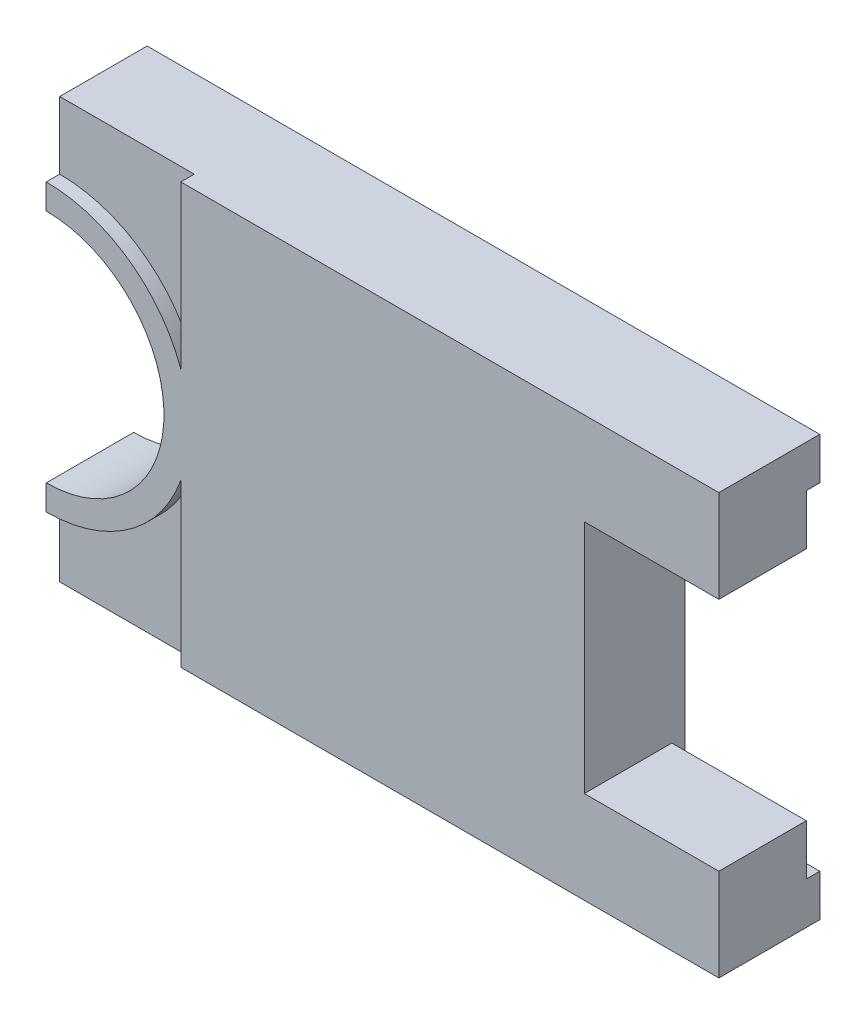
ISO-10303-21;
HEADER;
FILE_DESCRIPTION(('STEP AP214'),'2;1');
FILE_NAME('part.step','',(''),(''),'','','');
FILE_SCHEMA(('AUTOMOTIVE_DESIGN { 1 0 10303 214 1 1 1 1 }'));
ENDSEC;
DATA;
#1=APPLICATION_CONTEXT('core data for automotive mechanical design processes');
#2=APPLICATION_PROTOCOL_DEFINITION('international standard','automotive_design',2000,#1);
#3=PRODUCT_CONTEXT('',#1,'mechanical');
#4=PRODUCT('Part','Part','',(#3));
#5=PRODUCT_RELATED_PRODUCT_CATEGORY('part','',(#4));
#6=PRODUCT_DEFINITION_FORMATION('','',#4);
#7=PRODUCT_DEFINITION_CONTEXT('part definition',#1,'design');
#8=PRODUCT_DEFINITION('design','',#6,#7);
#9=PRODUCT_DEFINITION_SHAPE('','',#8);
#10=(LENGTH_UNIT() NAMED_UNIT(*) SI_UNIT(.MILLI.,.METRE.));
#11=(NAMED_UNIT(*) PLANE_ANGLE_UNIT() SI_UNIT($,.RADIAN.));
#12=(NAMED_UNIT(*) SI_UNIT($,.STERADIAN.) SOLID_ANGLE_UNIT());
#13=UNCERTAINTY_MEASURE_WITH_UNIT(LENGTH_MEASURE(1.E-05),#10,'distance_accuracy_value','');
#14=(GEOMETRIC_REPRESENTATION_CONTEXT(3) GLOBAL_UNCERTAINTY_ASSIGNED_CONTEXT((#13)) GLOBAL_UNIT_ASSIGNED_CONTEXT((#10,
#11,#12)) REPRESENTATION_CONTEXT('',''));
#15=CARTESIAN_POINT('',(0.,0.,0.));
#16=DIRECTION('',(0.,0.,1.));
#17=DIRECTION('',(1.,0.,0.));
#18=AXIS2_PLACEMENT_3D('',#15,#16,#17);
#19=CARTESIAN_POINT('',(-0.2,0.,0.04));
#20=DIRECTION('',(0.,0.,1.));
#21=DIRECTION('',(1.,0.,0.));
#22=AXIS2_PLACEMENT_3D('',#19,#20,#21);
#23=PLANE('',#22);
#24=DIRECTION('',(0.,-1.,0.));
#25=VECTOR('',#24,1.);
#26=CARTESIAN_POINT('',(0.2,-0.230940107676,0.04));
#27=LINE('',#26,#25);
#28=CARTESIAN_POINT('',(0.200000000000004,-0.230940107675994,0.04));
#29=VERTEX_POINT('',#28);
#30=CARTESIAN_POINT('',(0.2,0.230940107676,0.04));
#31=VERTEX_POINT('',#30);
#32=EDGE_CURVE('E160',#29,#31,#27,.F.);
#33=ORIENTED_EDGE('',*,*,#32,.F.);
#34=DIRECTION('',(-0.866025403784329,0.50000000000019,0.));
#35=VECTOR('',#34,1.);
#36=CARTESIAN_POINT('',(-0.2,0.,0.04));
#37=LINE('',#36,#35);
#38=CARTESIAN_POINT('',(-0.200000000000004,0.,0.04));
#39=VERTEX_POINT('',#38);
#40=EDGE_CURVE('E462',#39,#29,#37,.F.);
#41=ORIENTED_EDGE('',*,*,#40,.F.);
#42=DIRECTION('',(0.866025403784329,0.50000000000019,0.));
#43=VECTOR('',#42,1.);
#44=CARTESIAN_POINT('',(0.2,0.230940107676,0.04));
#45=LINE('',#44,#43);
#46=EDGE_CURVE('E453',#31,#39,#45,.F.);
#47=ORIENTED_EDGE('',*,*,#46,.F.);
#48=EDGE_LOOP('',(#33,#41,#47));
#49=FACE_BOUND('',#48,.T.);
#50=ADVANCED_FACE('F16',(#49),#23,.F.);
#51=CARTESIAN_POINT('',(-1.,-0.625,0.3));
#52=DIRECTION('',(0.,1.,0.));
#53=DIRECTION('',(-1.,0.,0.));
#54=AXIS2_PLACEMENT_3D('',#51,#52,#53);
#55=PLANE('',#54);
#56=DIRECTION('',(-1.,0.,0.));
#57=VECTOR('',#56,1.);
#58=CARTESIAN_POINT('',(-1.,-0.625,0.26));
#59=LINE('',#58,#57);
#60=CARTESIAN_POINT('',(-1.,-0.625,0.26));
#61=VERTEX_POINT('',#60);
#62=CARTESIAN_POINT('',(-0.6,-0.625,0.26));
#63=VERTEX_POINT('',#62);
#64=EDGE_CURVE('E161',#61,#63,#59,.F.);
#65=ORIENTED_EDGE('',*,*,#64,.F.);
#66=DIRECTION('',(0.,0.,1.));
#67=VECTOR('',#66,1.);
#68=CARTESIAN_POINT('',(-1.,-0.625,0.3));
#69=LINE('',#68,#67);
#70=CARTESIAN_POINT('',(-1.,-0.625,0.));
#71=VERTEX_POINT('',#70);
#72=EDGE_CURVE('E177',#71,#61,#69,.T.);
#73=ORIENTED_EDGE('',*,*,#72,.F.);
#74=DIRECTION('',(1.,0.,0.));
#75=VECTOR('',#74,1.);
#76=CARTESIAN_POINT('',(-1.,-0.625,0.));
#77=LINE('',#76,#75);
#78=CARTESIAN_POINT('',(1.,-0.625,0.));
#79=VERTEX_POINT('',#78);
#80=EDGE_CURVE('E413',#71,#79,#77,.T.);
#81=ORIENTED_EDGE('',*,*,#80,.T.);
#82=DIRECTION('',(0.,0.,1.));
#83=VECTOR('',#82,1.);
#84=CARTESIAN_POINT('',(1.,-0.625,0.3));
#85=LINE('',#84,#83);
#86=CARTESIAN_POINT('',(1.,-0.625,0.3));
#87=VERTEX_POINT('',#86);
#88=EDGE_CURVE('E175',#87,#79,#85,.F.);
#89=ORIENTED_EDGE('',*,*,#88,.F.);
#90=DIRECTION('',(-1.,0.,0.));
#91=VECTOR('',#90,1.);
#92=CARTESIAN_POINT('',(-1.,-0.625,0.3));
#93=LINE('',#92,#91);
#94=CARTESIAN_POINT('',(-0.6,-0.625,0.3));
#95=VERTEX_POINT('',#94);
#96=EDGE_CURVE('E167',#95,#87,#93,.F.);
#97=ORIENTED_EDGE('',*,*,#96,.F.);
#98=DIRECTION('',(0.,0.,1.));
#99=VECTOR('',#98,1.);
#100=CARTESIAN_POINT('',(-0.6,-0.625,0.3));
#101=LINE('',#100,#99);
#102=EDGE_CURVE('E150',#63,#95,#101,.T.);
#103=ORIENTED_EDGE('',*,*,#102,.F.);
#104=EDGE_LOOP('',(#65,#73,#81,#89,#97,#103));
#105=FACE_BOUND('',#104,.T.);
#106=ADVANCED_FACE('F173',(#105),#55,.F.);
#107=CARTESIAN_POINT('',(0.2,-0.230940107676,0.04));
#108=DIRECTION('',(-1.,0.,0.));
#109=DIRECTION('',(0.,-1.,0.));
#110=AXIS2_PLACEMENT_3D('',#107,#108,#109);
#111=PLANE('',#110);
#112=ORIENTED_EDGE('',*,*,#32,.T.);
#113=DIRECTION('',(0.,0.,1.));
#114=VECTOR('',#113,1.);
#115=CARTESIAN_POINT('',(0.2,0.230940107676,0.04));
#116=LINE('',#115,#114);
#117=CARTESIAN_POINT('',(0.2,0.230940107676,0.));
#118=VERTEX_POINT('',#117);
#119=EDGE_CURVE('E456',#118,#31,#116,.T.);
#120=ORIENTED_EDGE('',*,*,#119,.F.);
#121=DIRECTION('',(0.,1.,0.));
#122=VECTOR('',#121,1.);
#123=CARTESIAN_POINT('',(0.2,-0.625,0.));
#124=LINE('',#123,#122);
#125=CARTESIAN_POINT('',(0.200000000000004,-0.230940107675994,0.));
#126=VERTEX_POINT('',#125);
#127=EDGE_CURVE('E352',#118,#126,#124,.F.);
#128=ORIENTED_EDGE('',*,*,#127,.T.);
#129=DIRECTION('',(0.,0.,1.));
#130=VECTOR('',#129,1.);
#131=CARTESIAN_POINT('',(0.200000000000014,-0.230940107675975,0.04));
#132=LINE('',#131,#130);
#133=EDGE_CURVE('E459',#29,#126,#132,.F.);
#134=ORIENTED_EDGE('',*,*,#133,.F.);
#135=EDGE_LOOP('',(#112,#120,#128,#134));
#136=FACE_BOUND('',#135,.T.);
#137=ADVANCED_FACE('F512',(#136),#111,.T.);
#138=CARTESIAN_POINT('',(-0.2,0.,0.04));
#139=DIRECTION('',(0.50000000000019,0.866025403784329,0.));
#140=DIRECTION('',(-0.866025403784329,0.50000000000019,0.));
#141=AXIS2_PLACEMENT_3D('',#138,#139,#140);
#142=PLANE('',#141);
#143=ORIENTED_EDGE('',*,*,#40,.T.);
#144=ORIENTED_EDGE('',*,*,#133,.T.);
#145=DIRECTION('',(-0.866025403784298,0.500000000000243,0.));
#146=VECTOR('',#145,1.);
#147=CARTESIAN_POINT('',(0.2,-0.230940107676,0.));
#148=LINE('',#147,#146);
#149=CARTESIAN_POINT('',(-0.200000000000004,0.,0.));
#150=VERTEX_POINT('',#149);
#151=EDGE_CURVE('E349',#126,#150,#148,.T.);
#152=ORIENTED_EDGE('',*,*,#151,.T.);
#153=DIRECTION('',(0.,0.,1.));
#154=VECTOR('',#153,1.);
#155=CARTESIAN_POINT('',(-0.200000000000014,0.,0.04));
#156=LINE('',#155,#154);
#157=EDGE_CURVE('E401',#39,#150,#156,.F.);
#158=ORIENTED_EDGE('',*,*,#157,.F.);
#159=EDGE_LOOP('',(#143,#144,#152,#158));
#160=FACE_BOUND('',#159,.T.);
#161=ADVANCED_FACE('F517',(#160),#142,.T.);
#162=CARTESIAN_POINT('',(0.2,0.230940107676,0.04));
#163=DIRECTION('',(0.50000000000019,-0.866025403784329,0.));
#164=DIRECTION('',(0.866025403784329,0.50000000000019,0.));
#165=AXIS2_PLACEMENT_3D('',#162,#163,#164);
#166=PLANE('',#165);
#167=ORIENTED_EDGE('',*,*,#46,.T.);
#168=ORIENTED_EDGE('',*,*,#157,.T.);
#169=DIRECTION('',(0.866025403784298,0.500000000000243,0.));
#170=VECTOR('',#169,1.);
#171=CARTESIAN_POINT('',(-0.2,0.,0.));
#172=LINE('',#171,#170);
#173=EDGE_CURVE('E345',#150,#118,#172,.T.);
#174=ORIENTED_EDGE('',*,*,#173,.T.);
#175=ORIENTED_EDGE('',*,*,#119,.T.);
#176=EDGE_LOOP('',(#167,#168,#174,#175));
#177=FACE_BOUND('',#176,.T.);
#178=ADVANCED_FACE('F520',(#177),#166,.T.);
#179=CARTESIAN_POINT('',(-0.6,-0.35,2.377498685594));
#180=DIRECTION('',(-1.,0.,0.));
#181=DIRECTION('',(0.,0.,1.));
#182=AXIS2_PLACEMENT_3D('',#179,#180,#181);
#183=PLANE('',#182);
#184=DIRECTION('',(0.,1.,0.));
#185=VECTOR('',#184,1.);
#186=CARTESIAN_POINT('',(-0.6,-0.625,0.));
#187=LINE('',#186,#185);
#188=CARTESIAN_POINT('',(-0.6,0.5,0.));
#189=VERTEX_POINT('',#188);
#190=CARTESIAN_POINT('',(-0.6,-0.5,0.));
#191=VERTEX_POINT('',#190);
#192=EDGE_CURVE('E358',#189,#191,#187,.F.);
#193=ORIENTED_EDGE('',*,*,#192,.T.);
#194=DIRECTION('',(0.,0.,1.));
#195=VECTOR('',#194,1.);
#196=CARTESIAN_POINT('',(-0.6,-0.5,0.04));
#197=LINE('',#196,#195);
#198=CARTESIAN_POINT('',(-0.6,-0.5,0.04));
#199=VERTEX_POINT('',#198);
#200=EDGE_CURVE('E296',#199,#191,#197,.F.);
#201=ORIENTED_EDGE('',*,*,#200,.F.);
#202=DIRECTION('',(0.,1.,0.));
#203=VECTOR('',#202,1.);
#204=CARTESIAN_POINT('',(-0.6,-0.5,0.04));
#205=LINE('',#204,#203);
#206=CARTESIAN_POINT('',(-0.6,0.5,0.04));
#207=VERTEX_POINT('',#206);
#208=EDGE_CURVE('E295',#199,#207,#205,.T.);
#209=ORIENTED_EDGE('',*,*,#208,.T.);
#210=DIRECTION('',(0.,0.,-1.));
#211=VECTOR('',#210,1.);
#212=CARTESIAN_POINT('',(-0.6,0.5,0.04));
#213=LINE('',#212,#211);
#214=EDGE_CURVE('E304',#189,#207,#213,.F.);
#215=ORIENTED_EDGE('',*,*,#214,.F.);
#216=EDGE_LOOP('',(#193,#201,#209,#215));
#217=FACE_BOUND('',#216,.T.);
#218=ADVANCED_FACE('F847',(#217),#183,.T.);
#219=CARTESIAN_POINT('',(1.,-0.5,0.04));
#220=DIRECTION('',(0.,-1.,0.));
#221=DIRECTION('',(0.,0.,-1.));
#222=AXIS2_PLACEMENT_3D('',#219,#220,#221);
#223=PLANE('',#222);
#224=DIRECTION('',(0.,0.,1.));
#225=VECTOR('',#224,1.);
#226=CARTESIAN_POINT('',(0.6,-0.5,2.377498685594));
#227=LINE('',#226,#225);
#228=CARTESIAN_POINT('',(0.6,-0.5,0.));
#229=VERTEX_POINT('',#228);
#230=CARTESIAN_POINT('',(0.6,-0.5,0.0400000000000001));
#231=VERTEX_POINT('',#230);
#232=EDGE_CURVE('E392',#229,#231,#227,.T.);
#233=ORIENTED_EDGE('',*,*,#232,.T.);
#234=DIRECTION('',(-1.,0.,0.));
#235=VECTOR('',#234,1.);
#236=CARTESIAN_POINT('',(1.,-0.5,0.04));
#237=LINE('',#236,#235);
#238=CARTESIAN_POINT('',(1.,-0.5,0.04));
#239=VERTEX_POINT('',#238);
#240=EDGE_CURVE('E384',#239,#231,#237,.T.);
#241=ORIENTED_EDGE('',*,*,#240,.F.);
#242=DIRECTION('',(0.,0.,1.));
#243=VECTOR('',#242,1.);
#244=CARTESIAN_POINT('',(1.,-0.5,0.3));
#245=LINE('',#244,#243);
#246=CARTESIAN_POINT('',(1.,-0.5,0.));
#247=VERTEX_POINT('',#246);
#248=EDGE_CURVE('E419',#239,#247,#245,.F.);
#249=ORIENTED_EDGE('',*,*,#248,.T.);
#250=DIRECTION('',(1.,0.,0.));
#251=VECTOR('',#250,1.);
#252=CARTESIAN_POINT('',(-1.,-0.5,0.));
#253=LINE('',#252,#251);
#254=EDGE_CURVE('E355',#247,#229,#253,.F.);
#255=ORIENTED_EDGE('',*,*,#254,.T.);
#256=EDGE_LOOP('',(#233,#241,#249,#255));
#257=FACE_BOUND('',#256,.T.);
#258=ADVANCED_FACE('F838',(#257),#223,.F.);
#259=CARTESIAN_POINT('',(1.,-0.5,0.04));
#260=DIRECTION('',(0.,0.,-1.));
#261=DIRECTION('',(-1.,0.,0.));
#262=AXIS2_PLACEMENT_3D('',#259,#260,#261);
#263=PLANE('',#262);
#264=ORIENTED_EDGE('',*,*,#240,.T.);
#265=DIRECTION('',(0.,1.,0.));
#266=VECTOR('',#265,1.);
#267=CARTESIAN_POINT('',(0.6,-0.35,0.0400000000000001));
#268=LINE('',#267,#266);
#269=CARTESIAN_POINT('',(0.6,-0.35,0.0400000000000001));
#270=VERTEX_POINT('',#269);
#271=EDGE_CURVE('E264',#231,#270,#268,.T.);
#272=ORIENTED_EDGE('',*,*,#271,.T.);
#273=DIRECTION('',(1.,0.,0.));
#274=VECTOR('',#273,1.);
#275=CARTESIAN_POINT('',(1.,-0.35,0.0400000000000001));
#276=LINE('',#275,#274);
#277=CARTESIAN_POINT('',(1.,-0.35,0.0400000000000001));
#278=VERTEX_POINT('',#277);
#279=EDGE_CURVE('E274',#270,#278,#276,.T.);
#280=ORIENTED_EDGE('',*,*,#279,.T.);
#281=DIRECTION('',(0.,1.,0.));
#282=VECTOR('',#281,1.);
#283=CARTESIAN_POINT('',(1.,-0.625,0.04));
#284=LINE('',#283,#282);
#285=EDGE_CURVE('E416',#278,#239,#284,.F.);
#286=ORIENTED_EDGE('',*,*,#285,.T.);
#287=EDGE_LOOP('',(#264,#272,#280,#286));
#288=FACE_BOUND('',#287,.T.);
#289=ADVANCED_FACE('F540',(#288),#263,.T.);
#290=CARTESIAN_POINT('',(0.6,0.5,0.04));
#291=DIRECTION('',(0.,1.,0.));
#292=DIRECTION('',(0.,0.,1.));
#293=AXIS2_PLACEMENT_3D('',#290,#291,#292);
#294=PLANE('',#293);
#295=DIRECTION('',(0.,0.,1.));
#296=VECTOR('',#295,1.);
#297=CARTESIAN_POINT('',(1.,0.5,0.3));
#298=LINE('',#297,#296);
#299=CARTESIAN_POINT('',(1.,0.5,0.));
#300=VERTEX_POINT('',#299);
#301=CARTESIAN_POINT('',(1.,0.5,0.04));
#302=VERTEX_POINT('',#301);
#303=EDGE_CURVE('E342',#300,#302,#298,.T.);
#304=ORIENTED_EDGE('',*,*,#303,.T.);
#305=DIRECTION('',(-1.,0.,0.));
#306=VECTOR('',#305,1.);
#307=CARTESIAN_POINT('',(1.,0.5,0.04));
#308=LINE('',#307,#306);
#309=CARTESIAN_POINT('',(0.6,0.5,0.0400000000000001));
#310=VERTEX_POINT('',#309);
#311=EDGE_CURVE('E363',#310,#302,#308,.F.);
#312=ORIENTED_EDGE('',*,*,#311,.F.);
#313=DIRECTION('',(0.,0.,1.));
#314=VECTOR('',#313,1.);
#315=CARTESIAN_POINT('',(0.6,0.5,2.377498685594));
#316=LINE('',#315,#314);
#317=CARTESIAN_POINT('',(0.6,0.5,0.));
#318=VERTEX_POINT('',#317);
#319=EDGE_CURVE('E379',#310,#318,#316,.F.);
#320=ORIENTED_EDGE('',*,*,#319,.T.);
#321=DIRECTION('',(1.,0.,0.));
#322=VECTOR('',#321,1.);
#323=CARTESIAN_POINT('',(-1.,0.5,0.));
#324=LINE('',#323,#322);
#325=EDGE_CURVE('E359',#318,#300,#324,.T.);
#326=ORIENTED_EDGE('',*,*,#325,.T.);
#327=EDGE_LOOP('',(#304,#312,#320,#326));
#328=FACE_BOUND('',#327,.T.);
#329=ADVANCED_FACE('F819',(#328),#294,.F.);
#330=CARTESIAN_POINT('',(1.,-0.5,0.04));
#331=DIRECTION('',(0.,0.,-1.));
#332=DIRECTION('',(-1.,0.,0.));
#333=AXIS2_PLACEMENT_3D('',#330,#331,#332);
#334=PLANE('',#333);
#335=ORIENTED_EDGE('',*,*,#311,.T.);
#336=DIRECTION('',(0.,1.,0.));
#337=VECTOR('',#336,1.);
#338=CARTESIAN_POINT('',(1.,-0.625,0.04));
#339=LINE('',#338,#337);
#340=CARTESIAN_POINT('',(1.,0.35,0.04));
#341=VERTEX_POINT('',#340);
#342=EDGE_CURVE('E324',#302,#341,#339,.F.);
#343=ORIENTED_EDGE('',*,*,#342,.T.);
#344=DIRECTION('',(-1.,0.,0.));
#345=VECTOR('',#344,1.);
#346=CARTESIAN_POINT('',(0.6,0.35,0.0400000000000001));
#347=LINE('',#346,#345);
#348=CARTESIAN_POINT('',(0.6,0.35,0.0400000000000001));
#349=VERTEX_POINT('',#348);
#350=EDGE_CURVE('E241',#341,#349,#347,.T.);
#351=ORIENTED_EDGE('',*,*,#350,.T.);
#352=DIRECTION('',(0.,1.,0.));
#353=VECTOR('',#352,1.);
#354=CARTESIAN_POINT('',(0.6,-0.35,0.0400000000000001));
#355=LINE('',#354,#353);
#356=EDGE_CURVE('E263',#349,#310,#355,.T.);
#357=ORIENTED_EDGE('',*,*,#356,.T.);
#358=EDGE_LOOP('',(#335,#343,#351,#357));
#359=FACE_BOUND('',#358,.T.);
#360=ADVANCED_FACE('F809',(#359),#334,.T.);
#361=CARTESIAN_POINT('',(-1.,-0.625,0.));
#362=DIRECTION('',(0.,0.,1.));
#363=DIRECTION('',(1.,0.,0.));
#364=AXIS2_PLACEMENT_3D('',#361,#362,#363);
#365=PLANE('',#364);
#366=ORIENTED_EDGE('',*,*,#151,.F.);
#367=ORIENTED_EDGE('',*,*,#127,.F.);
#368=ORIENTED_EDGE('',*,*,#173,.F.);
#369=EDGE_LOOP('',(#366,#367,#368));
#370=FACE_BOUND('',#369,.T.);
#371=ORIENTED_EDGE('',*,*,#254,.F.);
#372=DIRECTION('',(0.,1.,0.));
#373=VECTOR('',#372,1.);
#374=CARTESIAN_POINT('',(1.,-0.625,0.));
#375=LINE('',#374,#373);
#376=EDGE_CURVE('E275',#247,#79,#375,.F.);
#377=ORIENTED_EDGE('',*,*,#376,.T.);
#378=ORIENTED_EDGE('',*,*,#80,.F.);
#379=DIRECTION('',(0.,1.,0.));
#380=VECTOR('',#379,1.);
#381=CARTESIAN_POINT('',(-1.,-0.625,0.));
#382=LINE('',#381,#380);
#383=CARTESIAN_POINT('',(-1.,-0.5,0.));
#384=VERTEX_POINT('',#383);
#385=EDGE_CURVE('E83',#384,#71,#382,.F.);
#386=ORIENTED_EDGE('',*,*,#385,.F.);
#387=DIRECTION('',(-1.,0.,0.));
#388=VECTOR('',#387,1.);
#389=CARTESIAN_POINT('',(-1.,-0.5,0.));
#390=LINE('',#389,#388);
#391=EDGE_CURVE('E302',#191,#384,#390,.T.);
#392=ORIENTED_EDGE('',*,*,#391,.F.);
#393=ORIENTED_EDGE('',*,*,#192,.F.);
#394=DIRECTION('',(1.,0.,0.));
#395=VECTOR('',#394,1.);
#396=CARTESIAN_POINT('',(-0.6,0.5,0.));
#397=LINE('',#396,#395);
#398=CARTESIAN_POINT('',(-1.,0.5,0.));
#399=VERTEX_POINT('',#398);
#400=EDGE_CURVE('E348',#399,#189,#397,.T.);
#401=ORIENTED_EDGE('',*,*,#400,.F.);
#402=DIRECTION('',(0.,1.,0.));
#403=VECTOR('',#402,1.);
#404=CARTESIAN_POINT('',(-1.,-0.625,0.));
#405=LINE('',#404,#403);
#406=CARTESIAN_POINT('',(-1.,0.625,0.));
#407=VERTEX_POINT('',#406);
#408=EDGE_CURVE('E356',#407,#399,#405,.F.);
#409=ORIENTED_EDGE('',*,*,#408,.F.);
#410=DIRECTION('',(1.,0.,0.));
#411=VECTOR('',#410,1.);
#412=CARTESIAN_POINT('',(1.,0.625,0.));
#413=LINE('',#412,#411);
#414=CARTESIAN_POINT('',(1.,0.625,0.));
#415=VERTEX_POINT('',#414);
#416=EDGE_CURVE('E229',#407,#415,#413,.T.);
#417=ORIENTED_EDGE('',*,*,#416,.T.);
#418=DIRECTION('',(0.,1.,0.));
#419=VECTOR('',#418,1.);
#420=CARTESIAN_POINT('',(1.,-0.625,0.));
#421=LINE('',#420,#419);
#422=EDGE_CURVE('E240',#415,#300,#421,.F.);
#423=ORIENTED_EDGE('',*,*,#422,.T.);
#424=ORIENTED_EDGE('',*,*,#325,.F.);
#425=DIRECTION('',(0.,1.,0.));
#426=VECTOR('',#425,1.);
#427=CARTESIAN_POINT('',(0.6,-0.35,0.));
#428=LINE('',#427,#426);
#429=EDGE_CURVE('E252',#318,#229,#428,.F.);
#430=ORIENTED_EDGE('',*,*,#429,.T.);
#431=EDGE_LOOP('',(#371,#377,#378,#386,#392,#393,#401,#409,#417,#423,#424,#430));
#432=FACE_BOUND('',#431,.T.);
#433=ADVANCED_FACE('F484',(#370,#432),#365,.F.);
#434=CARTESIAN_POINT('',(-0.6,0.5,0.04));
#435=DIRECTION('',(0.,-1.,0.));
#436=DIRECTION('',(0.,0.,-1.));
#437=AXIS2_PLACEMENT_3D('',#434,#435,#436);
#438=PLANE('',#437);
#439=DIRECTION('',(1.,0.,0.));
#440=VECTOR('',#439,1.);
#441=CARTESIAN_POINT('',(-1.,0.5,0.04));
#442=LINE('',#441,#440);
#443=CARTESIAN_POINT('',(-1.,0.5,0.04));
#444=VERTEX_POINT('',#443);
#445=EDGE_CURVE('E327',#207,#444,#442,.F.);
#446=ORIENTED_EDGE('',*,*,#445,.T.);
#447=DIRECTION('',(0.,0.,-1.));
#448=VECTOR('',#447,1.);
#449=CARTESIAN_POINT('',(-1.,0.5,0.3));
#450=LINE('',#449,#448);
#451=EDGE_CURVE('E206',#444,#399,#450,.T.);
#452=ORIENTED_EDGE('',*,*,#451,.T.);
#453=ORIENTED_EDGE('',*,*,#400,.T.);
#454=ORIENTED_EDGE('',*,*,#214,.T.);
#455=EDGE_LOOP('',(#446,#452,#453,#454));
#456=FACE_BOUND('',#455,.T.);
#457=ADVANCED_FACE('F600',(#456),#438,.T.);
#458=CARTESIAN_POINT('',(-1.,0.,0.26));
#459=DIRECTION('',(0.,0.,-1.));
#460=DIRECTION('',(-1.,0.,0.));
#461=AXIS2_PLACEMENT_3D('',#458,#459,#460);
#462=PLANE('',#461);
#463=DIRECTION('',(1.,0.,0.));
#464=VECTOR('',#463,1.);
#465=CARTESIAN_POINT('',(1.,0.625,0.26));
#466=LINE('',#465,#464);
#467=CARTESIAN_POINT('',(-0.6,0.625,0.26));
#468=VERTEX_POINT('',#467);
#469=CARTESIAN_POINT('',(-1.,0.625,0.26));
#470=VERTEX_POINT('',#469);
#471=EDGE_CURVE('E228',#468,#470,#466,.F.);
#472=ORIENTED_EDGE('',*,*,#471,.T.);
#473=DIRECTION('',(0.,1.,0.));
#474=VECTOR('',#473,1.);
#475=CARTESIAN_POINT('',(-1.,0.625,0.26));
#476=LINE('',#475,#474);
#477=CARTESIAN_POINT('',(-1.,0.425,0.26));
#478=VERTEX_POINT('',#477);
#479=EDGE_CURVE('E309',#470,#478,#476,.F.);
#480=ORIENTED_EDGE('',*,*,#479,.T.);
#481=CARTESIAN_POINT('',(-1.,0.,0.26));
#482=DIRECTION('',(0.,0.,-1.));
#483=DIRECTION('',(-1.,0.,0.));
#484=AXIS2_PLACEMENT_3D('',#481,#482,#483);
#485=CIRCLE('',#484,0.425);
#486=CARTESIAN_POINT('',(-0.599999999999928,0.143614066163251,0.26));
#487=VERTEX_POINT('',#486);
#488=EDGE_CURVE('E197',#487,#478,#485,.F.);
#489=ORIENTED_EDGE('',*,*,#488,.F.);
#490=DIRECTION('',(0.,1.,0.));
#491=VECTOR('',#490,1.);
#492=CARTESIAN_POINT('',(-0.6,0.143614066163,0.26));
#493=LINE('',#492,#491);
#494=EDGE_CURVE('E212',#487,#468,#493,.T.);
#495=ORIENTED_EDGE('',*,*,#494,.T.);
#496=EDGE_LOOP('',(#472,#480,#489,#495));
#497=FACE_BOUND('',#496,.T.);
#498=ADVANCED_FACE('F575',(#497),#462,.F.);
#499=CARTESIAN_POINT('',(-1.,0.,0.26));
#500=DIRECTION('',(0.,0.,1.));
#501=DIRECTION('',(1.,0.,0.));
#502=AXIS2_PLACEMENT_3D('',#499,#500,#501);
#503=PLANE('',#502);
#504=DIRECTION('',(0.,1.,0.));
#505=VECTOR('',#504,1.);
#506=CARTESIAN_POINT('',(-1.,0.625,0.26));
#507=LINE('',#506,#505);
#508=CARTESIAN_POINT('',(-1.,-0.425,0.26));
#509=VERTEX_POINT('',#508);
#510=EDGE_CURVE('E283',#509,#61,#507,.F.);
#511=ORIENTED_EDGE('',*,*,#510,.T.);
#512=ORIENTED_EDGE('',*,*,#64,.T.);
#513=DIRECTION('',(0.,-1.,0.));
#514=VECTOR('',#513,1.);
#515=CARTESIAN_POINT('',(-0.6,-0.143614066163,0.26));
#516=LINE('',#515,#514);
#517=CARTESIAN_POINT('',(-0.6,-0.143614066163225,0.26));
#518=VERTEX_POINT('',#517);
#519=EDGE_CURVE('E156',#518,#63,#516,.T.);
#520=ORIENTED_EDGE('',*,*,#519,.F.);
#521=CARTESIAN_POINT('',(-1.,0.,0.26));
#522=DIRECTION('',(0.,0.,-1.));
#523=DIRECTION('',(-1.,0.,0.));
#524=AXIS2_PLACEMENT_3D('',#521,#522,#523);
#525=CIRCLE('',#524,0.425);
#526=EDGE_CURVE('E19',#509,#518,#525,.F.);
#527=ORIENTED_EDGE('',*,*,#526,.F.);
#528=EDGE_LOOP('',(#511,#512,#520,#527));
#529=FACE_BOUND('',#528,.T.);
#530=ADVANCED_FACE('F479',(#529),#503,.T.);
#531=CARTESIAN_POINT('',(-1.,-0.5,0.04));
#532=DIRECTION('',(0.,1.,0.));
#533=DIRECTION('',(-1.,0.,0.));
#534=AXIS2_PLACEMENT_3D('',#531,#532,#533);
#535=PLANE('',#534);
#536=DIRECTION('',(1.,0.,0.));
#537=VECTOR('',#536,1.);
#538=CARTESIAN_POINT('',(-1.,-0.5,0.04));
#539=LINE('',#538,#537);
#540=CARTESIAN_POINT('',(-1.,-0.5,0.04));
#541=VERTEX_POINT('',#540);
#542=EDGE_CURVE('E292',#541,#199,#539,.T.);
#543=ORIENTED_EDGE('',*,*,#542,.T.);
#544=ORIENTED_EDGE('',*,*,#200,.T.);
#545=ORIENTED_EDGE('',*,*,#391,.T.);
#546=DIRECTION('',(0.,0.,-1.));
#547=VECTOR('',#546,1.);
#548=CARTESIAN_POINT('',(-1.,-0.5,0.3));
#549=LINE('',#548,#547);
#550=EDGE_CURVE('E285',#384,#541,#549,.F.);
#551=ORIENTED_EDGE('',*,*,#550,.T.);
#552=EDGE_LOOP('',(#543,#544,#545,#551));
#553=FACE_BOUND('',#552,.T.);
#554=ADVANCED_FACE('F620',(#553),#535,.T.);
#555=CARTESIAN_POINT('',(-1.,-0.5,0.04));
#556=DIRECTION('',(0.,0.,1.));
#557=DIRECTION('',(1.,0.,0.));
#558=AXIS2_PLACEMENT_3D('',#555,#556,#557);
#559=PLANE('',#558);
#560=CARTESIAN_POINT('',(-1.,0.,0.04));
#561=DIRECTION('',(0.,0.,-1.));
#562=DIRECTION('',(-1.,0.,0.));
#563=AXIS2_PLACEMENT_3D('',#560,#561,#562);
#564=CIRCLE('',#563,0.35);
#565=CARTESIAN_POINT('',(-1.,-0.35,0.04));
#566=VERTEX_POINT('',#565);
#567=CARTESIAN_POINT('',(-1.,0.35,0.04));
#568=VERTEX_POINT('',#567);
#569=EDGE_CURVE('E194',#566,#568,#564,.F.);
#570=ORIENTED_EDGE('',*,*,#569,.T.);
#571=DIRECTION('',(0.,1.,0.));
#572=VECTOR('',#571,1.);
#573=CARTESIAN_POINT('',(-1.,0.625,0.04));
#574=LINE('',#573,#572);
#575=EDGE_CURVE('E199',#568,#444,#574,.T.);
#576=ORIENTED_EDGE('',*,*,#575,.T.);
#577=ORIENTED_EDGE('',*,*,#445,.F.);
#578=ORIENTED_EDGE('',*,*,#208,.F.);
#579=ORIENTED_EDGE('',*,*,#542,.F.);
#580=DIRECTION('',(0.,1.,0.));
#581=VECTOR('',#580,1.);
#582=CARTESIAN_POINT('',(-1.,0.625,0.04));
#583=LINE('',#582,#581);
#584=EDGE_CURVE('E288',#541,#566,#583,.T.);
#585=ORIENTED_EDGE('',*,*,#584,.T.);
#586=EDGE_LOOP('',(#570,#576,#577,#578,#579,#585));
#587=FACE_BOUND('',#586,.T.);
#588=ADVANCED_FACE('F604',(#587),#559,.F.);
#589=CARTESIAN_POINT('',(-1.,0.,0.26));
#590=DIRECTION('',(0.,0.,-1.));
#591=DIRECTION('',(-1.,0.,0.));
#592=AXIS2_PLACEMENT_3D('',#589,#590,#591);
#593=CYLINDRICAL_SURFACE('',#592,0.425);
#594=ORIENTED_EDGE('',*,*,#526,.T.);
#595=DIRECTION('',(0.,0.,1.));
#596=VECTOR('',#595,1.);
#597=CARTESIAN_POINT('',(-0.6,-0.143614066163,0.26));
#598=LINE('',#597,#596);
#599=CARTESIAN_POINT('',(-0.6,-0.143614066163225,0.3));
#600=VERTEX_POINT('',#599);
#601=EDGE_CURVE('E281',#600,#518,#598,.F.);
#602=ORIENTED_EDGE('',*,*,#601,.F.);
#603=CARTESIAN_POINT('',(-1.,0.,0.3));
#604=DIRECTION('',(0.,0.,-1.));
#605=DIRECTION('',(-1.,0.,0.));
#606=AXIS2_PLACEMENT_3D('',#603,#604,#605);
#607=CIRCLE('',#606,0.425);
#608=CARTESIAN_POINT('',(-1.,-0.425,0.3));
#609=VERTEX_POINT('',#608);
#610=EDGE_CURVE('E169',#609,#600,#607,.F.);
#611=ORIENTED_EDGE('',*,*,#610,.F.);
#612=DIRECTION('',(0.,0.,-1.));
#613=VECTOR('',#612,1.);
#614=CARTESIAN_POINT('',(-1.,-0.425,0.3));
#615=LINE('',#614,#613);
#616=EDGE_CURVE('E193',#609,#509,#615,.T.);
#617=ORIENTED_EDGE('',*,*,#616,.T.);
#618=EDGE_LOOP('',(#594,#602,#611,#617));
#619=FACE_BOUND('',#618,.T.);
#620=ADVANCED_FACE('F611',(#619),#593,.T.);
#621=CARTESIAN_POINT('',(-0.6,-0.143614066163,0.26));
#622=DIRECTION('',(-1.,0.,0.));
#623=DIRECTION('',(0.,-1.,0.));
#624=AXIS2_PLACEMENT_3D('',#621,#622,#623);
#625=PLANE('',#624);
#626=ORIENTED_EDGE('',*,*,#519,.T.);
#627=ORIENTED_EDGE('',*,*,#102,.T.);
#628=DIRECTION('',(0.,1.,0.));
#629=VECTOR('',#628,1.);
#630=CARTESIAN_POINT('',(-0.6,-0.625,0.3));
#631=LINE('',#630,#629);
#632=EDGE_CURVE('E154',#600,#95,#631,.F.);
#633=ORIENTED_EDGE('',*,*,#632,.F.);
#634=ORIENTED_EDGE('',*,*,#601,.T.);
#635=EDGE_LOOP('',(#626,#627,#633,#634));
#636=FACE_BOUND('',#635,.T.);
#637=ADVANCED_FACE('F152',(#636),#625,.T.);
#638=CARTESIAN_POINT('',(1.,-0.625,0.3));
#639=DIRECTION('',(-1.,0.,0.));
#640=DIRECTION('',(0.,0.,1.));
#641=AXIS2_PLACEMENT_3D('',#638,#639,#640);
#642=PLANE('',#641);
#643=ORIENTED_EDGE('',*,*,#248,.F.);
#644=ORIENTED_EDGE('',*,*,#285,.F.);
#645=DIRECTION('',(0.,0.,1.));
#646=VECTOR('',#645,1.);
#647=CARTESIAN_POINT('',(1.,-0.35,2.377498685594));
#648=LINE('',#647,#646);
#649=CARTESIAN_POINT('',(1.,-0.35,0.3));
#650=VERTEX_POINT('',#649);
#651=EDGE_CURVE('E271',#278,#650,#648,.T.);
#652=ORIENTED_EDGE('',*,*,#651,.T.);
#653=DIRECTION('',(0.,1.,0.));
#654=VECTOR('',#653,1.);
#655=CARTESIAN_POINT('',(1.,-0.625,0.3));
#656=LINE('',#655,#654);
#657=EDGE_CURVE('E170',#87,#650,#656,.T.);
#658=ORIENTED_EDGE('',*,*,#657,.F.);
#659=ORIENTED_EDGE('',*,*,#88,.T.);
#660=ORIENTED_EDGE('',*,*,#376,.F.);
#661=EDGE_LOOP('',(#643,#644,#652,#658,#659,#660));
#662=FACE_BOUND('',#661,.T.);
#663=ADVANCED_FACE('F488',(#662),#642,.F.);
#664=CARTESIAN_POINT('',(1.,-0.35,2.377498685594));
#665=DIRECTION('',(0.,-1.,0.));
#666=DIRECTION('',(1.,0.,0.));
#667=AXIS2_PLACEMENT_3D('',#664,#665,#666);
#668=PLANE('',#667);
#669=DIRECTION('',(0.,0.,1.));
#670=VECTOR('',#669,1.);
#671=CARTESIAN_POINT('',(0.6,-0.35,2.377498685594));
#672=LINE('',#671,#670);
#673=CARTESIAN_POINT('',(0.6,-0.35,0.3));
#674=VERTEX_POINT('',#673);
#675=EDGE_CURVE('E260',#270,#674,#672,.T.);
#676=ORIENTED_EDGE('',*,*,#675,.T.);
#677=DIRECTION('',(1.,0.,0.));
#678=VECTOR('',#677,1.);
#679=CARTESIAN_POINT('',(-1.,-0.35,0.3));
#680=LINE('',#679,#678);
#681=EDGE_CURVE('E257',#650,#674,#680,.F.);
#682=ORIENTED_EDGE('',*,*,#681,.F.);
#683=ORIENTED_EDGE('',*,*,#651,.F.);
#684=ORIENTED_EDGE('',*,*,#279,.F.);
#685=EDGE_LOOP('',(#676,#682,#683,#684));
#686=FACE_BOUND('',#685,.T.);
#687=ADVANCED_FACE('F546',(#686),#668,.F.);
#688=CARTESIAN_POINT('',(0.6,-0.35,2.377498685594));
#689=DIRECTION('',(-1.,0.,0.));
#690=DIRECTION('',(0.,0.,1.));
#691=AXIS2_PLACEMENT_3D('',#688,#689,#690);
#692=PLANE('',#691);
#693=ORIENTED_EDGE('',*,*,#319,.F.);
#694=ORIENTED_EDGE('',*,*,#356,.F.);
#695=DIRECTION('',(0.,0.,1.));
#696=VECTOR('',#695,1.);
#697=CARTESIAN_POINT('',(0.6,0.35,2.377498685594));
#698=LINE('',#697,#696);
#699=CARTESIAN_POINT('',(0.6,0.35,0.3));
#700=VERTEX_POINT('',#699);
#701=EDGE_CURVE('E249',#349,#700,#698,.T.);
#702=ORIENTED_EDGE('',*,*,#701,.T.);
#703=DIRECTION('',(0.,1.,0.));
#704=VECTOR('',#703,1.);
#705=CARTESIAN_POINT('',(0.6,-0.625,0.3));
#706=LINE('',#705,#704);
#707=EDGE_CURVE('E246',#674,#700,#706,.T.);
#708=ORIENTED_EDGE('',*,*,#707,.F.);
#709=ORIENTED_EDGE('',*,*,#675,.F.);
#710=ORIENTED_EDGE('',*,*,#271,.F.);
#711=ORIENTED_EDGE('',*,*,#232,.F.);
#712=ORIENTED_EDGE('',*,*,#429,.F.);
#713=EDGE_LOOP('',(#693,#694,#702,#708,#709,#710,#711,#712));
#714=FACE_BOUND('',#713,.T.);
#715=ADVANCED_FACE('F550',(#714),#692,.F.);
#716=CARTESIAN_POINT('',(0.6,0.35,2.377498685594));
#717=DIRECTION('',(0.,1.,0.));
#718=DIRECTION('',(-1.,0.,0.));
#719=AXIS2_PLACEMENT_3D('',#716,#717,#718);
#720=PLANE('',#719);
#721=DIRECTION('',(0.,0.,1.));
#722=VECTOR('',#721,1.);
#723=CARTESIAN_POINT('',(1.,0.35,0.3));
#724=LINE('',#723,#722);
#725=CARTESIAN_POINT('',(1.,0.35,0.3));
#726=VERTEX_POINT('',#725);
#727=EDGE_CURVE('E237',#341,#726,#724,.T.);
#728=ORIENTED_EDGE('',*,*,#727,.T.);
#729=DIRECTION('',(1.,0.,0.));
#730=VECTOR('',#729,1.);
#731=CARTESIAN_POINT('',(-1.,0.35,0.3));
#732=LINE('',#731,#730);
#733=EDGE_CURVE('E234',#700,#726,#732,.T.);
#734=ORIENTED_EDGE('',*,*,#733,.F.);
#735=ORIENTED_EDGE('',*,*,#701,.F.);
#736=ORIENTED_EDGE('',*,*,#350,.F.);
#737=EDGE_LOOP('',(#728,#734,#735,#736));
#738=FACE_BOUND('',#737,.T.);
#739=ADVANCED_FACE('F555',(#738),#720,.F.);
#740=CARTESIAN_POINT('',(1.,-0.625,0.3));
#741=DIRECTION('',(-1.,0.,0.));
#742=DIRECTION('',(0.,0.,1.));
#743=AXIS2_PLACEMENT_3D('',#740,#741,#742);
#744=PLANE('',#743);
#745=ORIENTED_EDGE('',*,*,#303,.F.);
#746=ORIENTED_EDGE('',*,*,#422,.F.);
#747=DIRECTION('',(0.,0.,1.));
#748=VECTOR('',#747,1.);
#749=CARTESIAN_POINT('',(1.,0.625,0.3));
#750=LINE('',#749,#748);
#751=CARTESIAN_POINT('',(1.,0.625,0.3));
#752=VERTEX_POINT('',#751);
#753=EDGE_CURVE('E225',#415,#752,#750,.T.);
#754=ORIENTED_EDGE('',*,*,#753,.T.);
#755=DIRECTION('',(0.,1.,0.));
#756=VECTOR('',#755,1.);
#757=CARTESIAN_POINT('',(1.,-0.625,0.3));
#758=LINE('',#757,#756);
#759=EDGE_CURVE('E222',#726,#752,#758,.T.);
#760=ORIENTED_EDGE('',*,*,#759,.F.);
#761=ORIENTED_EDGE('',*,*,#727,.F.);
#762=ORIENTED_EDGE('',*,*,#342,.F.);
#763=EDGE_LOOP('',(#745,#746,#754,#760,#761,#762));
#764=FACE_BOUND('',#763,.T.);
#765=ADVANCED_FACE('F560',(#764),#744,.F.);
#766=CARTESIAN_POINT('',(1.,0.625,0.3));
#767=DIRECTION('',(0.,-1.,0.));
#768=DIRECTION('',(1.,0.,0.));
#769=AXIS2_PLACEMENT_3D('',#766,#767,#768);
#770=PLANE('',#769);
#771=DIRECTION('',(0.,0.,1.));
#772=VECTOR('',#771,1.);
#773=CARTESIAN_POINT('',(-0.6,0.625,0.26));
#774=LINE('',#773,#772);
#775=CARTESIAN_POINT('',(-0.6,0.625,0.3));
#776=VERTEX_POINT('',#775);
#777=EDGE_CURVE('E208',#468,#776,#774,.T.);
#778=ORIENTED_EDGE('',*,*,#777,.T.);
#779=DIRECTION('',(1.,0.,0.));
#780=VECTOR('',#779,1.);
#781=CARTESIAN_POINT('',(-1.,0.625,0.3));
#782=LINE('',#781,#780);
#783=EDGE_CURVE('E219',#752,#776,#782,.F.);
#784=ORIENTED_EDGE('',*,*,#783,.F.);
#785=ORIENTED_EDGE('',*,*,#753,.F.);
#786=ORIENTED_EDGE('',*,*,#416,.F.);
#787=DIRECTION('',(0.,0.,-1.));
#788=VECTOR('',#787,1.);
#789=CARTESIAN_POINT('',(-1.,0.625,0.3));
#790=LINE('',#789,#788);
#791=EDGE_CURVE('E311',#407,#470,#790,.F.);
#792=ORIENTED_EDGE('',*,*,#791,.T.);
#793=ORIENTED_EDGE('',*,*,#471,.F.);
#794=EDGE_LOOP('',(#778,#784,#785,#786,#792,#793));
#795=FACE_BOUND('',#794,.T.);
#796=ADVANCED_FACE('F566',(#795),#770,.F.);
#797=CARTESIAN_POINT('',(-0.6,0.143614066163,0.26));
#798=DIRECTION('',(1.,0.,0.));
#799=DIRECTION('',(0.,1.,0.));
#800=AXIS2_PLACEMENT_3D('',#797,#798,#799);
#801=PLANE('',#800);
#802=ORIENTED_EDGE('',*,*,#777,.F.);
#803=ORIENTED_EDGE('',*,*,#494,.F.);
#804=DIRECTION('',(0.,0.,-1.));
#805=VECTOR('',#804,1.);
#806=CARTESIAN_POINT('',(-0.599999999999857,0.143614066163051,0.26));
#807=LINE('',#806,#805);
#808=CARTESIAN_POINT('',(-0.599999999999928,0.143614066163251,0.3));
#809=VERTEX_POINT('',#808);
#810=EDGE_CURVE('E200',#809,#487,#807,.T.);
#811=ORIENTED_EDGE('',*,*,#810,.F.);
#812=DIRECTION('',(0.,1.,0.));
#813=VECTOR('',#812,1.);
#814=CARTESIAN_POINT('',(-0.6,-0.625,0.3));
#815=LINE('',#814,#813);
#816=EDGE_CURVE('E191',#776,#809,#815,.F.);
#817=ORIENTED_EDGE('',*,*,#816,.F.);
#818=EDGE_LOOP('',(#802,#803,#811,#817));
#819=FACE_BOUND('',#818,.T.);
#820=ADVANCED_FACE('F579',(#819),#801,.F.);
#821=CARTESIAN_POINT('',(-1.,0.,0.26));
#822=DIRECTION('',(0.,0.,-1.));
#823=DIRECTION('',(-1.,0.,0.));
#824=AXIS2_PLACEMENT_3D('',#821,#822,#823);
#825=CYLINDRICAL_SURFACE('',#824,0.425);
#826=ORIENTED_EDGE('',*,*,#488,.T.);
#827=DIRECTION('',(0.,0.,-1.));
#828=VECTOR('',#827,1.);
#829=CARTESIAN_POINT('',(-1.,0.425,0.3));
#830=LINE('',#829,#828);
#831=CARTESIAN_POINT('',(-1.,0.425,0.3));
#832=VERTEX_POINT('',#831);
#833=EDGE_CURVE('E196',#478,#832,#830,.F.);
#834=ORIENTED_EDGE('',*,*,#833,.T.);
#835=CARTESIAN_POINT('',(-1.,0.,0.3));
#836=DIRECTION('',(0.,0.,-1.));
#837=DIRECTION('',(-1.,0.,0.));
#838=AXIS2_PLACEMENT_3D('',#835,#836,#837);
#839=CIRCLE('',#838,0.425);
#840=EDGE_CURVE('E188',#809,#832,#839,.F.);
#841=ORIENTED_EDGE('',*,*,#840,.F.);
#842=ORIENTED_EDGE('',*,*,#810,.T.);
#843=EDGE_LOOP('',(#826,#834,#841,#842));
#844=FACE_BOUND('',#843,.T.);
#845=ADVANCED_FACE('F596',(#844),#825,.T.);
#846=CARTESIAN_POINT('',(-1.,0.625,0.3));
#847=DIRECTION('',(1.,0.,0.));
#848=DIRECTION('',(0.,0.,-1.));
#849=AXIS2_PLACEMENT_3D('',#846,#847,#848);
#850=PLANE('',#849);
#851=ORIENTED_EDGE('',*,*,#833,.F.);
#852=ORIENTED_EDGE('',*,*,#479,.F.);
#853=ORIENTED_EDGE('',*,*,#791,.F.);
#854=ORIENTED_EDGE('',*,*,#408,.T.);
#855=ORIENTED_EDGE('',*,*,#451,.F.);
#856=ORIENTED_EDGE('',*,*,#575,.F.);
#857=DIRECTION('',(0.,0.,-1.));
#858=VECTOR('',#857,1.);
#859=CARTESIAN_POINT('',(-1.,0.35,0.04));
#860=LINE('',#859,#858);
#861=CARTESIAN_POINT('',(-1.,0.35,0.3));
#862=VERTEX_POINT('',#861);
#863=EDGE_CURVE('E195',#568,#862,#860,.F.);
#864=ORIENTED_EDGE('',*,*,#863,.T.);
#865=DIRECTION('',(0.,1.,0.));
#866=VECTOR('',#865,1.);
#867=CARTESIAN_POINT('',(-1.,-0.625,0.3));
#868=LINE('',#867,#866);
#869=EDGE_CURVE('E187',#832,#862,#868,.F.);
#870=ORIENTED_EDGE('',*,*,#869,.F.);
#871=EDGE_LOOP('',(#851,#852,#853,#854,#855,#856,#864,#870));
#872=FACE_BOUND('',#871,.T.);
#873=ADVANCED_FACE('F592',(#872),#850,.F.);
#874=CARTESIAN_POINT('',(-1.,0.,0.04));
#875=DIRECTION('',(0.,0.,-1.));
#876=DIRECTION('',(-1.,0.,0.));
#877=AXIS2_PLACEMENT_3D('',#874,#875,#876);
#878=CYLINDRICAL_SURFACE('',#877,0.35);
#879=ORIENTED_EDGE('',*,*,#863,.F.);
#880=ORIENTED_EDGE('',*,*,#569,.F.);
#881=DIRECTION('',(0.,0.,-1.));
#882=VECTOR('',#881,1.);
#883=CARTESIAN_POINT('',(-1.,-0.35,0.3));
#884=LINE('',#883,#882);
#885=CARTESIAN_POINT('',(-1.,-0.35,0.3));
#886=VERTEX_POINT('',#885);
#887=EDGE_CURVE('E34',#566,#886,#884,.F.);
#888=ORIENTED_EDGE('',*,*,#887,.T.);
#889=CARTESIAN_POINT('',(-1.,0.,0.3));
#890=DIRECTION('',(0.,0.,-1.));
#891=DIRECTION('',(-1.,0.,0.));
#892=AXIS2_PLACEMENT_3D('',#889,#890,#891);
#893=CIRCLE('',#892,0.35);
#894=EDGE_CURVE('E25',#862,#886,#893,.T.);
#895=ORIENTED_EDGE('',*,*,#894,.F.);
#896=EDGE_LOOP('',(#879,#880,#888,#895));
#897=FACE_BOUND('',#896,.T.);
#898=ADVANCED_FACE('F595',(#897),#878,.F.);
#899=CARTESIAN_POINT('',(-1.,0.625,0.3));
#900=DIRECTION('',(1.,0.,0.));
#901=DIRECTION('',(0.,0.,-1.));
#902=AXIS2_PLACEMENT_3D('',#899,#900,#901);
#903=PLANE('',#902);
#904=DIRECTION('',(0.,1.,0.));
#905=VECTOR('',#904,1.);
#906=CARTESIAN_POINT('',(-1.,-0.625,0.3));
#907=LINE('',#906,#905);
#908=EDGE_CURVE('E11',#886,#609,#907,.F.);
#909=ORIENTED_EDGE('',*,*,#908,.F.);
#910=ORIENTED_EDGE('',*,*,#887,.F.);
#911=ORIENTED_EDGE('',*,*,#584,.F.);
#912=ORIENTED_EDGE('',*,*,#550,.F.);
#913=ORIENTED_EDGE('',*,*,#385,.T.);
#914=ORIENTED_EDGE('',*,*,#72,.T.);
#915=ORIENTED_EDGE('',*,*,#510,.F.);
#916=ORIENTED_EDGE('',*,*,#616,.F.);
#917=EDGE_LOOP('',(#909,#910,#911,#912,#913,#914,#915,#916));
#918=FACE_BOUND('',#917,.T.);
#919=ADVANCED_FACE('F607',(#918),#903,.F.);
#920=CARTESIAN_POINT('',(-1.,-0.625,0.3));
#921=DIRECTION('',(0.,0.,1.));
#922=DIRECTION('',(1.,0.,0.));
#923=AXIS2_PLACEMENT_3D('',#920,#921,#922);
#924=PLANE('',#923);
#925=ORIENTED_EDGE('',*,*,#894,.T.);
#926=ORIENTED_EDGE('',*,*,#908,.T.);
#927=ORIENTED_EDGE('',*,*,#610,.T.);
#928=ORIENTED_EDGE('',*,*,#632,.T.);
#929=ORIENTED_EDGE('',*,*,#96,.T.);
#930=ORIENTED_EDGE('',*,*,#657,.T.);
#931=ORIENTED_EDGE('',*,*,#681,.T.);
#932=ORIENTED_EDGE('',*,*,#707,.T.);
#933=ORIENTED_EDGE('',*,*,#733,.T.);
#934=ORIENTED_EDGE('',*,*,#759,.T.);
#935=ORIENTED_EDGE('',*,*,#783,.T.);
#936=ORIENTED_EDGE('',*,*,#816,.T.);
#937=ORIENTED_EDGE('',*,*,#840,.T.);
#938=ORIENTED_EDGE('',*,*,#869,.T.);
#939=EDGE_LOOP('',(#925,#926,#927,#928,#929,#930,#931,#932,#933,#934,#935,#936,#937,#938));
#940=FACE_BOUND('',#939,.T.);
#941=ADVANCED_FACE('F165',(#940),#924,.T.);
#942=CLOSED_SHELL('',(#50,#106,#137,#161,#178,#218,#258,#289,#329,#360,#433,#457,#498,#530,#554,
#588,#620,#637,#663,#687,#715,#739,#765,#796,#820,#845,#873,#898,#919,#941));
#943=MANIFOLD_SOLID_BREP('B1',#942);
#944=ADVANCED_BREP_SHAPE_REPRESENTATION('',(#18,#943),#14);
#945=SHAPE_DEFINITION_REPRESENTATION(#9,#944);
ENDSEC;
END-ISO-10303-21;
